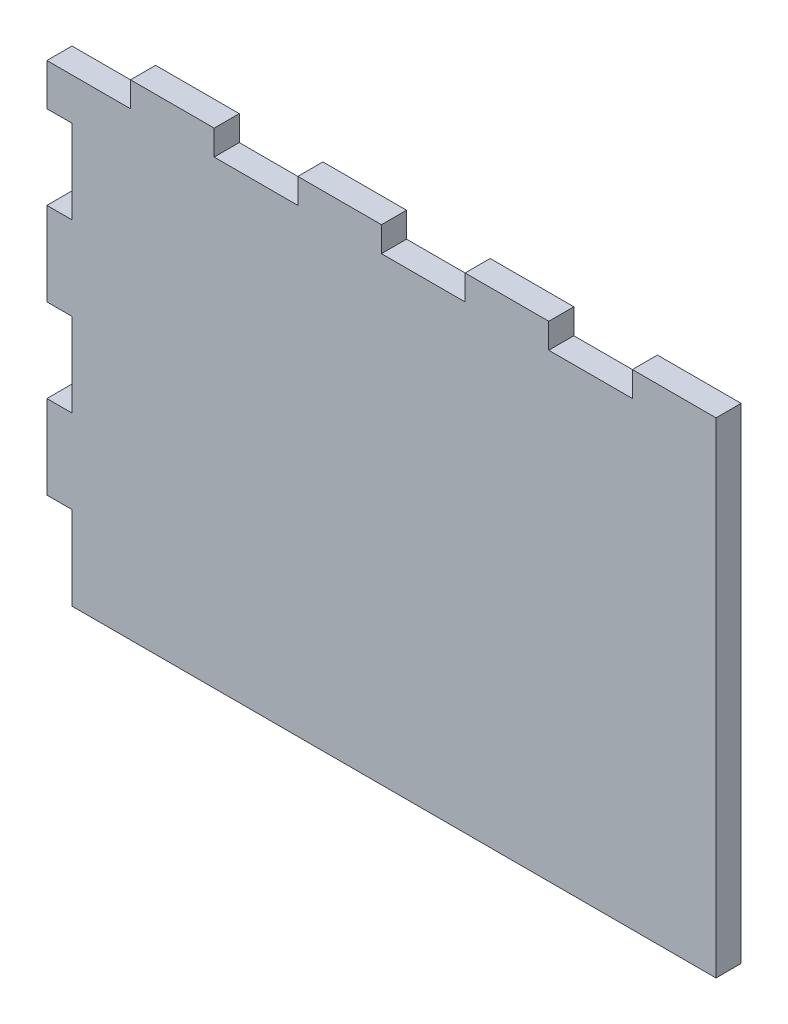
ISO-10303-21;
HEADER;
FILE_DESCRIPTION(('STEP AP214'),'2;1');
FILE_NAME('part.step','',(''),(''),'','','');
FILE_SCHEMA(('AUTOMOTIVE_DESIGN { 1 0 10303 214 1 1 1 1 }'));
ENDSEC;
DATA;
#1=APPLICATION_CONTEXT('core data for automotive mechanical design processes');
#2=APPLICATION_PROTOCOL_DEFINITION('international standard','automotive_design',2000,#1);
#3=PRODUCT_CONTEXT('',#1,'mechanical');
#4=PRODUCT('Part','Part','',(#3));
#5=PRODUCT_RELATED_PRODUCT_CATEGORY('part','',(#4));
#6=PRODUCT_DEFINITION_FORMATION('','',#4);
#7=PRODUCT_DEFINITION_CONTEXT('part definition',#1,'design');
#8=PRODUCT_DEFINITION('design','',#6,#7);
#9=PRODUCT_DEFINITION_SHAPE('','',#8);
#10=(LENGTH_UNIT() NAMED_UNIT(*) SI_UNIT(.MILLI.,.METRE.));
#11=(NAMED_UNIT(*) PLANE_ANGLE_UNIT() SI_UNIT($,.RADIAN.));
#12=(NAMED_UNIT(*) SI_UNIT($,.STERADIAN.) SOLID_ANGLE_UNIT());
#13=UNCERTAINTY_MEASURE_WITH_UNIT(LENGTH_MEASURE(1.E-05),#10,'distance_accuracy_value','');
#14=(GEOMETRIC_REPRESENTATION_CONTEXT(3) GLOBAL_UNCERTAINTY_ASSIGNED_CONTEXT((#13)) GLOBAL_UNIT_ASSIGNED_CONTEXT((#10,
#11,#12)) REPRESENTATION_CONTEXT('',''));
#15=CARTESIAN_POINT('',(0.,0.,0.));
#16=DIRECTION('',(0.,0.,1.));
#17=DIRECTION('',(1.,0.,0.));
#18=AXIS2_PLACEMENT_3D('',#15,#16,#17);
#19=CARTESIAN_POINT('',(0.,0.,3.));
#20=DIRECTION('',(1.,0.,0.));
#21=DIRECTION('',(0.,1.,0.));
#22=AXIS2_PLACEMENT_3D('',#19,#20,#21);
#23=PLANE('',#22);
#24=DIRECTION('',(0.,-1.,0.));
#25=VECTOR('',#24,1.);
#26=CARTESIAN_POINT('',(0.,0.,0.));
#27=LINE('',#26,#25);
#28=CARTESIAN_POINT('',(0.,-18.,0.));
#29=VERTEX_POINT('',#28);
#30=CARTESIAN_POINT('',(0.,-28.,0.));
#31=VERTEX_POINT('',#30);
#32=EDGE_CURVE('E242',#29,#31,#27,.T.);
#33=ORIENTED_EDGE('',*,*,#32,.T.);
#34=DIRECTION('',(0.,0.,1.));
#35=VECTOR('',#34,1.);
#36=CARTESIAN_POINT('',(0.,-28.,0.));
#37=LINE('',#36,#35);
#38=CARTESIAN_POINT('',(0.,-28.,3.));
#39=VERTEX_POINT('',#38);
#40=EDGE_CURVE('E402',#31,#39,#37,.T.);
#41=ORIENTED_EDGE('',*,*,#40,.T.);
#42=DIRECTION('',(0.,-1.,0.));
#43=VECTOR('',#42,1.);
#44=CARTESIAN_POINT('',(0.,0.,3.));
#45=LINE('',#44,#43);
#46=CARTESIAN_POINT('',(0.,-18.,3.));
#47=VERTEX_POINT('',#46);
#48=EDGE_CURVE('E296',#47,#39,#45,.T.);
#49=ORIENTED_EDGE('',*,*,#48,.F.);
#50=DIRECTION('',(0.,0.,1.));
#51=VECTOR('',#50,1.);
#52=CARTESIAN_POINT('',(0.,-18.,0.));
#53=LINE('',#52,#51);
#54=EDGE_CURVE('E405',#29,#47,#53,.T.);
#55=ORIENTED_EDGE('',*,*,#54,.F.);
#56=EDGE_LOOP('',(#33,#41,#49,#55));
#57=FACE_BOUND('',#56,.T.);
#58=ADVANCED_FACE('F35',(#57),#23,.F.);
#59=CARTESIAN_POINT('',(0.,-3.,0.));
#60=VERTEX_POINT('',#59);
#61=CARTESIAN_POINT('',(0.,-8.,0.));
#62=VERTEX_POINT('',#61);
#63=EDGE_CURVE('E245',#60,#62,#27,.T.);
#64=ORIENTED_EDGE('',*,*,#63,.T.);
#65=DIRECTION('',(0.,0.,1.));
#66=VECTOR('',#65,1.);
#67=CARTESIAN_POINT('',(0.,-8.,0.));
#68=LINE('',#67,#66);
#69=CARTESIAN_POINT('',(0.,-8.,3.));
#70=VERTEX_POINT('',#69);
#71=EDGE_CURVE('E412',#62,#70,#68,.T.);
#72=ORIENTED_EDGE('',*,*,#71,.T.);
#73=CARTESIAN_POINT('',(0.,-3.,3.));
#74=VERTEX_POINT('',#73);
#75=EDGE_CURVE('E291',#74,#70,#45,.T.);
#76=ORIENTED_EDGE('',*,*,#75,.F.);
#77=DIRECTION('',(0.,0.,1.));
#78=VECTOR('',#77,1.);
#79=CARTESIAN_POINT('',(0.,-3.,0.));
#80=LINE('',#79,#78);
#81=EDGE_CURVE('E297',#60,#74,#80,.T.);
#82=ORIENTED_EDGE('',*,*,#81,.F.);
#83=EDGE_LOOP('',(#64,#72,#76,#82));
#84=FACE_BOUND('',#83,.T.);
#85=ADVANCED_FACE('F460',(#84),#23,.F.);
#86=CARTESIAN_POINT('',(0.,0.,3.));
#87=DIRECTION('',(0.,-1.,0.));
#88=DIRECTION('',(0.,0.,-1.));
#89=AXIS2_PLACEMENT_3D('',#86,#87,#88);
#90=PLANE('',#89);
#91=DIRECTION('',(-1.,0.,0.));
#92=VECTOR('',#91,1.);
#93=CARTESIAN_POINT('',(0.,0.,3.));
#94=LINE('',#93,#92);
#95=CARTESIAN_POINT('',(20.,0.,3.));
#96=VERTEX_POINT('',#95);
#97=CARTESIAN_POINT('',(10.,0.,3.));
#98=VERTEX_POINT('',#97);
#99=EDGE_CURVE('E277',#96,#98,#94,.T.);
#100=ORIENTED_EDGE('',*,*,#99,.F.);
#101=DIRECTION('',(0.,0.,1.));
#102=VECTOR('',#101,1.);
#103=CARTESIAN_POINT('',(20.,0.,0.));
#104=LINE('',#103,#102);
#105=CARTESIAN_POINT('',(20.,0.,0.));
#106=VERTEX_POINT('',#105);
#107=EDGE_CURVE('E307',#106,#96,#104,.T.);
#108=ORIENTED_EDGE('',*,*,#107,.F.);
#109=DIRECTION('',(-1.,0.,0.));
#110=VECTOR('',#109,1.);
#111=CARTESIAN_POINT('',(0.,0.,0.));
#112=LINE('',#111,#110);
#113=CARTESIAN_POINT('',(10.,0.,0.));
#114=VERTEX_POINT('',#113);
#115=EDGE_CURVE('E263',#106,#114,#112,.T.);
#116=ORIENTED_EDGE('',*,*,#115,.T.);
#117=DIRECTION('',(0.,0.,1.));
#118=VECTOR('',#117,1.);
#119=CARTESIAN_POINT('',(10.,0.,0.));
#120=LINE('',#119,#118);
#121=EDGE_CURVE('E243',#114,#98,#120,.T.);
#122=ORIENTED_EDGE('',*,*,#121,.T.);
#123=EDGE_LOOP('',(#100,#108,#116,#122));
#124=FACE_BOUND('',#123,.T.);
#125=ADVANCED_FACE('F470',(#124),#90,.F.);
#126=CARTESIAN_POINT('',(40.,0.,0.));
#127=VERTEX_POINT('',#126);
#128=CARTESIAN_POINT('',(30.,0.,0.));
#129=VERTEX_POINT('',#128);
#130=EDGE_CURVE('E472',#127,#129,#112,.T.);
#131=ORIENTED_EDGE('',*,*,#130,.T.);
#132=DIRECTION('',(0.,0.,1.));
#133=VECTOR('',#132,1.);
#134=CARTESIAN_POINT('',(30.,0.,0.));
#135=LINE('',#134,#133);
#136=CARTESIAN_POINT('',(30.,0.,3.));
#137=VERTEX_POINT('',#136);
#138=EDGE_CURVE('E371',#129,#137,#135,.T.);
#139=ORIENTED_EDGE('',*,*,#138,.T.);
#140=CARTESIAN_POINT('',(40.,0.,3.));
#141=VERTEX_POINT('',#140);
#142=EDGE_CURVE('E281',#141,#137,#94,.T.);
#143=ORIENTED_EDGE('',*,*,#142,.F.);
#144=DIRECTION('',(0.,0.,1.));
#145=VECTOR('',#144,1.);
#146=CARTESIAN_POINT('',(40.,0.,0.));
#147=LINE('',#146,#145);
#148=EDGE_CURVE('E348',#127,#141,#147,.T.);
#149=ORIENTED_EDGE('',*,*,#148,.F.);
#150=EDGE_LOOP('',(#131,#139,#143,#149));
#151=FACE_BOUND('',#150,.T.);
#152=ADVANCED_FACE('F525',(#151),#90,.F.);
#153=CARTESIAN_POINT('',(60.,0.,0.));
#154=VERTEX_POINT('',#153);
#155=CARTESIAN_POINT('',(50.,0.,0.));
#156=VERTEX_POINT('',#155);
#157=EDGE_CURVE('E268',#154,#156,#112,.T.);
#158=ORIENTED_EDGE('',*,*,#157,.T.);
#159=DIRECTION('',(0.,0.,1.));
#160=VECTOR('',#159,1.);
#161=CARTESIAN_POINT('',(50.,0.,0.));
#162=LINE('',#161,#160);
#163=CARTESIAN_POINT('',(50.,0.,3.));
#164=VERTEX_POINT('',#163);
#165=EDGE_CURVE('E345',#156,#164,#162,.T.);
#166=ORIENTED_EDGE('',*,*,#165,.T.);
#167=CARTESIAN_POINT('',(60.,0.,3.));
#168=VERTEX_POINT('',#167);
#169=EDGE_CURVE('E276',#168,#164,#94,.T.);
#170=ORIENTED_EDGE('',*,*,#169,.F.);
#171=DIRECTION('',(0.,0.,1.));
#172=VECTOR('',#171,1.);
#173=CARTESIAN_POINT('',(60.,0.,0.));
#174=LINE('',#173,#172);
#175=EDGE_CURVE('E320',#154,#168,#174,.T.);
#176=ORIENTED_EDGE('',*,*,#175,.F.);
#177=EDGE_LOOP('',(#158,#166,#170,#176));
#178=FACE_BOUND('',#177,.T.);
#179=ADVANCED_FACE('F481',(#178),#90,.F.);
#180=CARTESIAN_POINT('',(0.,-38.,3.));
#181=VERTEX_POINT('',#180);
#182=CARTESIAN_POINT('',(0.,-48.,3.));
#183=VERTEX_POINT('',#182);
#184=EDGE_CURVE('E235',#181,#183,#45,.T.);
#185=ORIENTED_EDGE('',*,*,#184,.F.);
#186=DIRECTION('',(0.,0.,1.));
#187=VECTOR('',#186,1.);
#188=CARTESIAN_POINT('',(0.,-38.,0.));
#189=LINE('',#188,#187);
#190=CARTESIAN_POINT('',(0.,-38.,0.));
#191=VERTEX_POINT('',#190);
#192=EDGE_CURVE('E223',#191,#181,#189,.T.);
#193=ORIENTED_EDGE('',*,*,#192,.F.);
#194=CARTESIAN_POINT('',(0.,-48.,0.));
#195=VERTEX_POINT('',#194);
#196=EDGE_CURVE('E233',#191,#195,#27,.T.);
#197=ORIENTED_EDGE('',*,*,#196,.T.);
#198=DIRECTION('',(0.,0.,1.));
#199=VECTOR('',#198,1.);
#200=CARTESIAN_POINT('',(0.,-48.,0.));
#201=LINE('',#200,#199);
#202=EDGE_CURVE('E332',#195,#183,#201,.T.);
#203=ORIENTED_EDGE('',*,*,#202,.T.);
#204=EDGE_LOOP('',(#185,#193,#197,#203));
#205=FACE_BOUND('',#204,.T.);
#206=ADVANCED_FACE('F37',(#205),#23,.F.);
#207=CARTESIAN_POINT('',(0.,-58.,3.));
#208=DIRECTION('',(0.,1.,0.));
#209=DIRECTION('',(0.,0.,1.));
#210=AXIS2_PLACEMENT_3D('',#207,#208,#209);
#211=PLANE('',#210);
#212=DIRECTION('',(1.,0.,0.));
#213=VECTOR('',#212,1.);
#214=CARTESIAN_POINT('',(0.,-58.,3.));
#215=LINE('',#214,#213);
#216=CARTESIAN_POINT('',(3.,-58.,3.));
#217=VERTEX_POINT('',#216);
#218=CARTESIAN_POINT('',(80.,-58.,3.));
#219=VERTEX_POINT('',#218);
#220=EDGE_CURVE('E289',#217,#219,#215,.T.);
#221=ORIENTED_EDGE('',*,*,#220,.F.);
#222=DIRECTION('',(0.,0.,1.));
#223=VECTOR('',#222,1.);
#224=CARTESIAN_POINT('',(3.,-58.,0.));
#225=LINE('',#224,#223);
#226=CARTESIAN_POINT('',(3.,-58.,0.));
#227=VERTEX_POINT('',#226);
#228=EDGE_CURVE('E390',#227,#217,#225,.T.);
#229=ORIENTED_EDGE('',*,*,#228,.F.);
#230=DIRECTION('',(1.,0.,0.));
#231=VECTOR('',#230,1.);
#232=CARTESIAN_POINT('',(0.,-58.,0.));
#233=LINE('',#232,#231);
#234=CARTESIAN_POINT('',(80.,-58.,0.));
#235=VERTEX_POINT('',#234);
#236=EDGE_CURVE('E253',#227,#235,#233,.T.);
#237=ORIENTED_EDGE('',*,*,#236,.T.);
#238=DIRECTION('',(0.,0.,-1.));
#239=VECTOR('',#238,1.);
#240=CARTESIAN_POINT('',(80.,-58.,3.));
#241=LINE('',#240,#239);
#242=EDGE_CURVE('E11',#219,#235,#241,.T.);
#243=ORIENTED_EDGE('',*,*,#242,.F.);
#244=EDGE_LOOP('',(#221,#229,#237,#243));
#245=FACE_BOUND('',#244,.T.);
#246=ADVANCED_FACE('F519',(#245),#211,.F.);
#247=CARTESIAN_POINT('',(80.,0.,3.));
#248=DIRECTION('',(-1.,0.,0.));
#249=DIRECTION('',(0.,-1.,0.));
#250=AXIS2_PLACEMENT_3D('',#247,#248,#249);
#251=PLANE('',#250);
#252=DIRECTION('',(0.,1.,0.));
#253=VECTOR('',#252,1.);
#254=CARTESIAN_POINT('',(80.,0.,0.));
#255=LINE('',#254,#253);
#256=CARTESIAN_POINT('',(80.,0.,0.));
#257=VERTEX_POINT('',#256);
#258=EDGE_CURVE('E258',#235,#257,#255,.T.);
#259=ORIENTED_EDGE('',*,*,#258,.T.);
#260=DIRECTION('',(0.,0.,-1.));
#261=VECTOR('',#260,1.);
#262=CARTESIAN_POINT('',(80.,0.,3.));
#263=LINE('',#262,#261);
#264=CARTESIAN_POINT('',(80.,0.,3.));
#265=VERTEX_POINT('',#264);
#266=EDGE_CURVE('E43',#265,#257,#263,.T.);
#267=ORIENTED_EDGE('',*,*,#266,.F.);
#268=DIRECTION('',(0.,1.,0.));
#269=VECTOR('',#268,1.);
#270=CARTESIAN_POINT('',(80.,0.,3.));
#271=LINE('',#270,#269);
#272=EDGE_CURVE('E283',#219,#265,#271,.T.);
#273=ORIENTED_EDGE('',*,*,#272,.F.);
#274=ORIENTED_EDGE('',*,*,#242,.T.);
#275=EDGE_LOOP('',(#259,#267,#273,#274));
#276=FACE_BOUND('',#275,.T.);
#277=ADVANCED_FACE('F524',(#276),#251,.F.);
#278=CARTESIAN_POINT('',(70.,0.,0.));
#279=VERTEX_POINT('',#278);
#280=EDGE_CURVE('E266',#257,#279,#112,.T.);
#281=ORIENTED_EDGE('',*,*,#280,.T.);
#282=DIRECTION('',(0.,0.,1.));
#283=VECTOR('',#282,1.);
#284=CARTESIAN_POINT('',(70.,0.,0.));
#285=LINE('',#284,#283);
#286=CARTESIAN_POINT('',(70.,0.,3.));
#287=VERTEX_POINT('',#286);
#288=EDGE_CURVE('E317',#279,#287,#285,.T.);
#289=ORIENTED_EDGE('',*,*,#288,.T.);
#290=EDGE_CURVE('E270',#265,#287,#94,.T.);
#291=ORIENTED_EDGE('',*,*,#290,.F.);
#292=ORIENTED_EDGE('',*,*,#266,.T.);
#293=EDGE_LOOP('',(#281,#289,#291,#292));
#294=FACE_BOUND('',#293,.T.);
#295=ADVANCED_FACE('F502',(#294),#90,.F.);
#296=CARTESIAN_POINT('',(0.,0.,3.));
#297=DIRECTION('',(0.,0.,1.));
#298=DIRECTION('',(1.,0.,0.));
#299=AXIS2_PLACEMENT_3D('',#296,#297,#298);
#300=PLANE('',#299);
#301=DIRECTION('',(-1.,0.,0.));
#302=VECTOR('',#301,1.);
#303=CARTESIAN_POINT('',(0.,-28.,3.));
#304=LINE('',#303,#302);
#305=CARTESIAN_POINT('',(3.,-28.,3.));
#306=VERTEX_POINT('',#305);
#307=EDGE_CURVE('E228',#306,#39,#304,.T.);
#308=ORIENTED_EDGE('',*,*,#307,.F.);
#309=DIRECTION('',(0.,1.,0.));
#310=VECTOR('',#309,1.);
#311=CARTESIAN_POINT('',(3.,-38.,3.));
#312=LINE('',#311,#310);
#313=CARTESIAN_POINT('',(3.,-38.,3.));
#314=VERTEX_POINT('',#313);
#315=EDGE_CURVE('E435',#314,#306,#312,.T.);
#316=ORIENTED_EDGE('',*,*,#315,.F.);
#317=DIRECTION('',(1.,0.,0.));
#318=VECTOR('',#317,1.);
#319=CARTESIAN_POINT('',(0.,-38.,3.));
#320=LINE('',#319,#318);
#321=EDGE_CURVE('E414',#181,#314,#320,.T.);
#322=ORIENTED_EDGE('',*,*,#321,.F.);
#323=ORIENTED_EDGE('',*,*,#184,.T.);
#324=DIRECTION('',(-1.,0.,0.));
#325=VECTOR('',#324,1.);
#326=CARTESIAN_POINT('',(0.,-48.,3.));
#327=LINE('',#326,#325);
#328=CARTESIAN_POINT('',(3.,-48.,3.));
#329=VERTEX_POINT('',#328);
#330=EDGE_CURVE('E395',#329,#183,#327,.T.);
#331=ORIENTED_EDGE('',*,*,#330,.F.);
#332=DIRECTION('',(0.,1.,0.));
#333=VECTOR('',#332,1.);
#334=CARTESIAN_POINT('',(3.,-58.,3.));
#335=LINE('',#334,#333);
#336=EDGE_CURVE('E399',#217,#329,#335,.T.);
#337=ORIENTED_EDGE('',*,*,#336,.F.);
#338=ORIENTED_EDGE('',*,*,#220,.T.);
#339=ORIENTED_EDGE('',*,*,#272,.T.);
#340=ORIENTED_EDGE('',*,*,#290,.T.);
#341=DIRECTION('',(0.,1.,0.));
#342=VECTOR('',#341,1.);
#343=CARTESIAN_POINT('',(70.,0.,3.));
#344=LINE('',#343,#342);
#345=CARTESIAN_POINT('',(70.,-3.,3.));
#346=VERTEX_POINT('',#345);
#347=EDGE_CURVE('E323',#346,#287,#344,.T.);
#348=ORIENTED_EDGE('',*,*,#347,.F.);
#349=DIRECTION('',(1.,0.,0.));
#350=VECTOR('',#349,1.);
#351=CARTESIAN_POINT('',(60.,-3.,3.));
#352=LINE('',#351,#350);
#353=CARTESIAN_POINT('',(60.,-3.,3.));
#354=VERTEX_POINT('',#353);
#355=EDGE_CURVE('E326',#354,#346,#352,.T.);
#356=ORIENTED_EDGE('',*,*,#355,.F.);
#357=DIRECTION('',(0.,-1.,0.));
#358=VECTOR('',#357,1.);
#359=CARTESIAN_POINT('',(60.,0.,3.));
#360=LINE('',#359,#358);
#361=EDGE_CURVE('E329',#168,#354,#360,.T.);
#362=ORIENTED_EDGE('',*,*,#361,.F.);
#363=ORIENTED_EDGE('',*,*,#169,.T.);
#364=DIRECTION('',(0.,1.,0.));
#365=VECTOR('',#364,1.);
#366=CARTESIAN_POINT('',(50.,0.,3.));
#367=LINE('',#366,#365);
#368=CARTESIAN_POINT('',(50.,-3.,3.));
#369=VERTEX_POINT('',#368);
#370=EDGE_CURVE('E351',#369,#164,#367,.T.);
#371=ORIENTED_EDGE('',*,*,#370,.F.);
#372=DIRECTION('',(1.,0.,0.));
#373=VECTOR('',#372,1.);
#374=CARTESIAN_POINT('',(40.,-3.,3.));
#375=LINE('',#374,#373);
#376=CARTESIAN_POINT('',(40.,-3.,3.));
#377=VERTEX_POINT('',#376);
#378=EDGE_CURVE('E354',#377,#369,#375,.T.);
#379=ORIENTED_EDGE('',*,*,#378,.F.);
#380=DIRECTION('',(0.,-1.,0.));
#381=VECTOR('',#380,1.);
#382=CARTESIAN_POINT('',(40.,0.,3.));
#383=LINE('',#382,#381);
#384=EDGE_CURVE('E322',#141,#377,#383,.T.);
#385=ORIENTED_EDGE('',*,*,#384,.F.);
#386=ORIENTED_EDGE('',*,*,#142,.T.);
#387=DIRECTION('',(0.,1.,0.));
#388=VECTOR('',#387,1.);
#389=CARTESIAN_POINT('',(30.,0.,3.));
#390=LINE('',#389,#388);
#391=CARTESIAN_POINT('',(30.,-3.,3.));
#392=VERTEX_POINT('',#391);
#393=EDGE_CURVE('E375',#392,#137,#390,.T.);
#394=ORIENTED_EDGE('',*,*,#393,.F.);
#395=DIRECTION('',(1.,0.,0.));
#396=VECTOR('',#395,1.);
#397=CARTESIAN_POINT('',(20.,-3.,3.));
#398=LINE('',#397,#396);
#399=CARTESIAN_POINT('',(20.,-3.,3.));
#400=VERTEX_POINT('',#399);
#401=EDGE_CURVE('E378',#400,#392,#398,.T.);
#402=ORIENTED_EDGE('',*,*,#401,.F.);
#403=DIRECTION('',(0.,-1.,0.));
#404=VECTOR('',#403,1.);
#405=CARTESIAN_POINT('',(20.,0.,3.));
#406=LINE('',#405,#404);
#407=EDGE_CURVE('E350',#96,#400,#406,.T.);
#408=ORIENTED_EDGE('',*,*,#407,.F.);
#409=ORIENTED_EDGE('',*,*,#99,.T.);
#410=DIRECTION('',(0.,1.,0.));
#411=VECTOR('',#410,1.);
#412=CARTESIAN_POINT('',(10.,0.,3.));
#413=LINE('',#412,#411);
#414=CARTESIAN_POINT('',(10.,-3.,3.));
#415=VERTEX_POINT('',#414);
#416=EDGE_CURVE('E301',#415,#98,#413,.T.);
#417=ORIENTED_EDGE('',*,*,#416,.F.);
#418=DIRECTION('',(1.,0.,0.));
#419=VECTOR('',#418,1.);
#420=CARTESIAN_POINT('',(0.,-3.,3.));
#421=LINE('',#420,#419);
#422=EDGE_CURVE('E304',#74,#415,#421,.T.);
#423=ORIENTED_EDGE('',*,*,#422,.F.);
#424=ORIENTED_EDGE('',*,*,#75,.T.);
#425=DIRECTION('',(-1.,0.,0.));
#426=VECTOR('',#425,1.);
#427=CARTESIAN_POINT('',(0.,-8.,3.));
#428=LINE('',#427,#426);
#429=CARTESIAN_POINT('',(3.,-8.,3.));
#430=VERTEX_POINT('',#429);
#431=EDGE_CURVE('E415',#430,#70,#428,.T.);
#432=ORIENTED_EDGE('',*,*,#431,.F.);
#433=DIRECTION('',(0.,1.,0.));
#434=VECTOR('',#433,1.);
#435=CARTESIAN_POINT('',(3.,-18.,3.));
#436=LINE('',#435,#434);
#437=CARTESIAN_POINT('',(3.,-18.,3.));
#438=VERTEX_POINT('',#437);
#439=EDGE_CURVE('E418',#438,#430,#436,.T.);
#440=ORIENTED_EDGE('',*,*,#439,.F.);
#441=DIRECTION('',(1.,0.,0.));
#442=VECTOR('',#441,1.);
#443=CARTESIAN_POINT('',(0.,-18.,3.));
#444=LINE('',#443,#442);
#445=EDGE_CURVE('E421',#47,#438,#444,.T.);
#446=ORIENTED_EDGE('',*,*,#445,.F.);
#447=ORIENTED_EDGE('',*,*,#48,.T.);
#448=EDGE_LOOP('',(#308,#316,#322,#323,#331,#337,#338,#339,#340,#348,#356,#362,#363,#371,#379,
#385,#386,#394,#402,#408,#409,#417,#423,#424,#432,#440,#446,#447));
#449=FACE_BOUND('',#448,.T.);
#450=ADVANCED_FACE('F453',(#449),#300,.T.);
#451=CARTESIAN_POINT('',(0.,0.,0.));
#452=DIRECTION('',(0.,0.,1.));
#453=DIRECTION('',(1.,0.,0.));
#454=AXIS2_PLACEMENT_3D('',#451,#452,#453);
#455=PLANE('',#454);
#456=DIRECTION('',(0.,1.,0.));
#457=VECTOR('',#456,1.);
#458=CARTESIAN_POINT('',(3.,-38.,0.));
#459=LINE('',#458,#457);
#460=CARTESIAN_POINT('',(3.,-38.,0.));
#461=VERTEX_POINT('',#460);
#462=CARTESIAN_POINT('',(3.,-28.,0.));
#463=VERTEX_POINT('',#462);
#464=EDGE_CURVE('E50',#461,#463,#459,.T.);
#465=ORIENTED_EDGE('',*,*,#464,.T.);
#466=DIRECTION('',(-1.,0.,0.));
#467=VECTOR('',#466,1.);
#468=CARTESIAN_POINT('',(0.,-28.,0.));
#469=LINE('',#468,#467);
#470=EDGE_CURVE('E236',#463,#31,#469,.T.);
#471=ORIENTED_EDGE('',*,*,#470,.T.);
#472=ORIENTED_EDGE('',*,*,#32,.F.);
#473=DIRECTION('',(1.,0.,0.));
#474=VECTOR('',#473,1.);
#475=CARTESIAN_POINT('',(0.,-18.,0.));
#476=LINE('',#475,#474);
#477=CARTESIAN_POINT('',(3.,-18.,0.));
#478=VERTEX_POINT('',#477);
#479=EDGE_CURVE('E417',#29,#478,#476,.T.);
#480=ORIENTED_EDGE('',*,*,#479,.T.);
#481=DIRECTION('',(0.,1.,0.));
#482=VECTOR('',#481,1.);
#483=CARTESIAN_POINT('',(3.,-18.,0.));
#484=LINE('',#483,#482);
#485=CARTESIAN_POINT('',(3.,-8.,0.));
#486=VERTEX_POINT('',#485);
#487=EDGE_CURVE('E58',#478,#486,#484,.T.);
#488=ORIENTED_EDGE('',*,*,#487,.T.);
#489=DIRECTION('',(-1.,0.,0.));
#490=VECTOR('',#489,1.);
#491=CARTESIAN_POINT('',(0.,-8.,0.));
#492=LINE('',#491,#490);
#493=EDGE_CURVE('E408',#486,#62,#492,.T.);
#494=ORIENTED_EDGE('',*,*,#493,.T.);
#495=ORIENTED_EDGE('',*,*,#63,.F.);
#496=DIRECTION('',(1.,0.,0.));
#497=VECTOR('',#496,1.);
#498=CARTESIAN_POINT('',(0.,-3.,0.));
#499=LINE('',#498,#497);
#500=CARTESIAN_POINT('',(10.,-3.,0.));
#501=VERTEX_POINT('',#500);
#502=EDGE_CURVE('E303',#60,#501,#499,.T.);
#503=ORIENTED_EDGE('',*,*,#502,.T.);
#504=DIRECTION('',(0.,1.,0.));
#505=VECTOR('',#504,1.);
#506=CARTESIAN_POINT('',(10.,0.,0.));
#507=LINE('',#506,#505);
#508=EDGE_CURVE('E299',#501,#114,#507,.T.);
#509=ORIENTED_EDGE('',*,*,#508,.T.);
#510=ORIENTED_EDGE('',*,*,#115,.F.);
#511=DIRECTION('',(0.,-1.,0.));
#512=VECTOR('',#511,1.);
#513=CARTESIAN_POINT('',(20.,0.,0.));
#514=LINE('',#513,#512);
#515=CARTESIAN_POINT('',(20.,-3.,0.));
#516=VERTEX_POINT('',#515);
#517=EDGE_CURVE('E377',#106,#516,#514,.T.);
#518=ORIENTED_EDGE('',*,*,#517,.T.);
#519=DIRECTION('',(1.,0.,0.));
#520=VECTOR('',#519,1.);
#521=CARTESIAN_POINT('',(20.,-3.,0.));
#522=LINE('',#521,#520);
#523=CARTESIAN_POINT('',(30.,-3.,0.));
#524=VERTEX_POINT('',#523);
#525=EDGE_CURVE('E385',#516,#524,#522,.T.);
#526=ORIENTED_EDGE('',*,*,#525,.T.);
#527=DIRECTION('',(0.,1.,0.));
#528=VECTOR('',#527,1.);
#529=CARTESIAN_POINT('',(30.,0.,0.));
#530=LINE('',#529,#528);
#531=EDGE_CURVE('E369',#524,#129,#530,.T.);
#532=ORIENTED_EDGE('',*,*,#531,.T.);
#533=ORIENTED_EDGE('',*,*,#130,.F.);
#534=DIRECTION('',(0.,-1.,0.));
#535=VECTOR('',#534,1.);
#536=CARTESIAN_POINT('',(40.,0.,0.));
#537=LINE('',#536,#535);
#538=CARTESIAN_POINT('',(40.,-3.,0.));
#539=VERTEX_POINT('',#538);
#540=EDGE_CURVE('E353',#127,#539,#537,.T.);
#541=ORIENTED_EDGE('',*,*,#540,.T.);
#542=DIRECTION('',(1.,0.,0.));
#543=VECTOR('',#542,1.);
#544=CARTESIAN_POINT('',(40.,-3.,0.));
#545=LINE('',#544,#543);
#546=CARTESIAN_POINT('',(50.,-3.,0.));
#547=VERTEX_POINT('',#546);
#548=EDGE_CURVE('E361',#539,#547,#545,.T.);
#549=ORIENTED_EDGE('',*,*,#548,.T.);
#550=DIRECTION('',(0.,1.,0.));
#551=VECTOR('',#550,1.);
#552=CARTESIAN_POINT('',(50.,0.,0.));
#553=LINE('',#552,#551);
#554=EDGE_CURVE('E343',#547,#156,#553,.T.);
#555=ORIENTED_EDGE('',*,*,#554,.T.);
#556=ORIENTED_EDGE('',*,*,#157,.F.);
#557=DIRECTION('',(0.,-1.,0.));
#558=VECTOR('',#557,1.);
#559=CARTESIAN_POINT('',(60.,0.,0.));
#560=LINE('',#559,#558);
#561=CARTESIAN_POINT('',(60.,-3.,0.));
#562=VERTEX_POINT('',#561);
#563=EDGE_CURVE('E325',#154,#562,#560,.T.);
#564=ORIENTED_EDGE('',*,*,#563,.T.);
#565=DIRECTION('',(1.,0.,0.));
#566=VECTOR('',#565,1.);
#567=CARTESIAN_POINT('',(60.,-3.,0.));
#568=LINE('',#567,#566);
#569=CARTESIAN_POINT('',(70.,-3.,0.));
#570=VERTEX_POINT('',#569);
#571=EDGE_CURVE('E335',#562,#570,#568,.T.);
#572=ORIENTED_EDGE('',*,*,#571,.T.);
#573=DIRECTION('',(0.,1.,0.));
#574=VECTOR('',#573,1.);
#575=CARTESIAN_POINT('',(70.,0.,0.));
#576=LINE('',#575,#574);
#577=EDGE_CURVE('E315',#570,#279,#576,.T.);
#578=ORIENTED_EDGE('',*,*,#577,.T.);
#579=ORIENTED_EDGE('',*,*,#280,.F.);
#580=ORIENTED_EDGE('',*,*,#258,.F.);
#581=ORIENTED_EDGE('',*,*,#236,.F.);
#582=DIRECTION('',(0.,1.,0.));
#583=VECTOR('',#582,1.);
#584=CARTESIAN_POINT('',(3.,-58.,0.));
#585=LINE('',#584,#583);
#586=CARTESIAN_POINT('',(3.,-48.,0.));
#587=VERTEX_POINT('',#586);
#588=EDGE_CURVE('E398',#227,#587,#585,.T.);
#589=ORIENTED_EDGE('',*,*,#588,.T.);
#590=DIRECTION('',(-1.,0.,0.));
#591=VECTOR('',#590,1.);
#592=CARTESIAN_POINT('',(0.,-48.,0.));
#593=LINE('',#592,#591);
#594=EDGE_CURVE('E241',#587,#195,#593,.T.);
#595=ORIENTED_EDGE('',*,*,#594,.T.);
#596=ORIENTED_EDGE('',*,*,#196,.F.);
#597=DIRECTION('',(1.,0.,0.));
#598=VECTOR('',#597,1.);
#599=CARTESIAN_POINT('',(0.,-38.,0.));
#600=LINE('',#599,#598);
#601=EDGE_CURVE('E219',#191,#461,#600,.T.);
#602=ORIENTED_EDGE('',*,*,#601,.T.);
#603=EDGE_LOOP('',(#465,#471,#472,#480,#488,#494,#495,#503,#509,#510,#518,#526,#532,#533,#541,
#549,#555,#556,#564,#572,#578,#579,#580,#581,#589,#595,#596,#602));
#604=FACE_BOUND('',#603,.T.);
#605=ADVANCED_FACE('F239',(#604),#455,.F.);
#606=CARTESIAN_POINT('',(10.,0.,0.));
#607=DIRECTION('',(1.,0.,0.));
#608=DIRECTION('',(0.,0.,-1.));
#609=AXIS2_PLACEMENT_3D('',#606,#607,#608);
#610=PLANE('',#609);
#611=ORIENTED_EDGE('',*,*,#416,.T.);
#612=ORIENTED_EDGE('',*,*,#121,.F.);
#613=ORIENTED_EDGE('',*,*,#508,.F.);
#614=DIRECTION('',(0.,0.,1.));
#615=VECTOR('',#614,1.);
#616=CARTESIAN_POINT('',(10.,-3.,0.));
#617=LINE('',#616,#615);
#618=EDGE_CURVE('E248',#501,#415,#617,.T.);
#619=ORIENTED_EDGE('',*,*,#618,.T.);
#620=EDGE_LOOP('',(#611,#612,#613,#619));
#621=FACE_BOUND('',#620,.T.);
#622=ADVANCED_FACE('F468',(#621),#610,.F.);
#623=CARTESIAN_POINT('',(0.,-3.,0.));
#624=DIRECTION('',(0.,-1.,0.));
#625=DIRECTION('',(0.,0.,-1.));
#626=AXIS2_PLACEMENT_3D('',#623,#624,#625);
#627=PLANE('',#626);
#628=ORIENTED_EDGE('',*,*,#422,.T.);
#629=ORIENTED_EDGE('',*,*,#618,.F.);
#630=ORIENTED_EDGE('',*,*,#502,.F.);
#631=ORIENTED_EDGE('',*,*,#81,.T.);
#632=EDGE_LOOP('',(#628,#629,#630,#631));
#633=FACE_BOUND('',#632,.T.);
#634=ADVANCED_FACE('F464',(#633),#627,.F.);
#635=CARTESIAN_POINT('',(60.,0.,0.));
#636=DIRECTION('',(-1.,0.,0.));
#637=DIRECTION('',(0.,-1.,0.));
#638=AXIS2_PLACEMENT_3D('',#635,#636,#637);
#639=PLANE('',#638);
#640=ORIENTED_EDGE('',*,*,#361,.T.);
#641=DIRECTION('',(0.,0.,1.));
#642=VECTOR('',#641,1.);
#643=CARTESIAN_POINT('',(60.,-3.,0.));
#644=LINE('',#643,#642);
#645=EDGE_CURVE('E312',#562,#354,#644,.T.);
#646=ORIENTED_EDGE('',*,*,#645,.F.);
#647=ORIENTED_EDGE('',*,*,#563,.F.);
#648=ORIENTED_EDGE('',*,*,#175,.T.);
#649=EDGE_LOOP('',(#640,#646,#647,#648));
#650=FACE_BOUND('',#649,.T.);
#651=ADVANCED_FACE('F495',(#650),#639,.F.);
#652=CARTESIAN_POINT('',(70.,0.,0.));
#653=DIRECTION('',(1.,0.,0.));
#654=DIRECTION('',(0.,0.,-1.));
#655=AXIS2_PLACEMENT_3D('',#652,#653,#654);
#656=PLANE('',#655);
#657=ORIENTED_EDGE('',*,*,#347,.T.);
#658=ORIENTED_EDGE('',*,*,#288,.F.);
#659=ORIENTED_EDGE('',*,*,#577,.F.);
#660=DIRECTION('',(0.,0.,1.));
#661=VECTOR('',#660,1.);
#662=CARTESIAN_POINT('',(70.,-3.,0.));
#663=LINE('',#662,#661);
#664=EDGE_CURVE('E314',#570,#346,#663,.T.);
#665=ORIENTED_EDGE('',*,*,#664,.T.);
#666=EDGE_LOOP('',(#657,#658,#659,#665));
#667=FACE_BOUND('',#666,.T.);
#668=ADVANCED_FACE('F503',(#667),#656,.F.);
#669=CARTESIAN_POINT('',(60.,-3.,0.));
#670=DIRECTION('',(0.,-1.,0.));
#671=DIRECTION('',(0.,0.,-1.));
#672=AXIS2_PLACEMENT_3D('',#669,#670,#671);
#673=PLANE('',#672);
#674=ORIENTED_EDGE('',*,*,#355,.T.);
#675=ORIENTED_EDGE('',*,*,#664,.F.);
#676=ORIENTED_EDGE('',*,*,#571,.F.);
#677=ORIENTED_EDGE('',*,*,#645,.T.);
#678=EDGE_LOOP('',(#674,#675,#676,#677));
#679=FACE_BOUND('',#678,.T.);
#680=ADVANCED_FACE('F499',(#679),#673,.F.);
#681=CARTESIAN_POINT('',(40.,0.,0.));
#682=DIRECTION('',(-1.,0.,0.));
#683=DIRECTION('',(0.,-1.,0.));
#684=AXIS2_PLACEMENT_3D('',#681,#682,#683);
#685=PLANE('',#684);
#686=ORIENTED_EDGE('',*,*,#384,.T.);
#687=DIRECTION('',(0.,0.,1.));
#688=VECTOR('',#687,1.);
#689=CARTESIAN_POINT('',(40.,-3.,0.));
#690=LINE('',#689,#688);
#691=EDGE_CURVE('E340',#539,#377,#690,.T.);
#692=ORIENTED_EDGE('',*,*,#691,.F.);
#693=ORIENTED_EDGE('',*,*,#540,.F.);
#694=ORIENTED_EDGE('',*,*,#148,.T.);
#695=EDGE_LOOP('',(#686,#692,#693,#694));
#696=FACE_BOUND('',#695,.T.);
#697=ADVANCED_FACE('F510',(#696),#685,.F.);
#698=CARTESIAN_POINT('',(50.,0.,0.));
#699=DIRECTION('',(1.,0.,0.));
#700=DIRECTION('',(0.,0.,-1.));
#701=AXIS2_PLACEMENT_3D('',#698,#699,#700);
#702=PLANE('',#701);
#703=ORIENTED_EDGE('',*,*,#370,.T.);
#704=ORIENTED_EDGE('',*,*,#165,.F.);
#705=ORIENTED_EDGE('',*,*,#554,.F.);
#706=DIRECTION('',(0.,0.,1.));
#707=VECTOR('',#706,1.);
#708=CARTESIAN_POINT('',(50.,-3.,0.));
#709=LINE('',#708,#707);
#710=EDGE_CURVE('E342',#547,#369,#709,.T.);
#711=ORIENTED_EDGE('',*,*,#710,.T.);
#712=EDGE_LOOP('',(#703,#704,#705,#711));
#713=FACE_BOUND('',#712,.T.);
#714=ADVANCED_FACE('F486',(#713),#702,.F.);
#715=CARTESIAN_POINT('',(40.,-3.,0.));
#716=DIRECTION('',(0.,-1.,0.));
#717=DIRECTION('',(0.,0.,-1.));
#718=AXIS2_PLACEMENT_3D('',#715,#716,#717);
#719=PLANE('',#718);
#720=ORIENTED_EDGE('',*,*,#378,.T.);
#721=ORIENTED_EDGE('',*,*,#710,.F.);
#722=ORIENTED_EDGE('',*,*,#548,.F.);
#723=ORIENTED_EDGE('',*,*,#691,.T.);
#724=EDGE_LOOP('',(#720,#721,#722,#723));
#725=FACE_BOUND('',#724,.T.);
#726=ADVANCED_FACE('F488',(#725),#719,.F.);
#727=CARTESIAN_POINT('',(20.,0.,0.));
#728=DIRECTION('',(-1.,0.,0.));
#729=DIRECTION('',(0.,-1.,0.));
#730=AXIS2_PLACEMENT_3D('',#727,#728,#729);
#731=PLANE('',#730);
#732=ORIENTED_EDGE('',*,*,#407,.T.);
#733=DIRECTION('',(0.,0.,1.));
#734=VECTOR('',#733,1.);
#735=CARTESIAN_POINT('',(20.,-3.,0.));
#736=LINE('',#735,#734);
#737=EDGE_CURVE('E366',#516,#400,#736,.T.);
#738=ORIENTED_EDGE('',*,*,#737,.F.);
#739=ORIENTED_EDGE('',*,*,#517,.F.);
#740=ORIENTED_EDGE('',*,*,#107,.T.);
#741=EDGE_LOOP('',(#732,#738,#739,#740));
#742=FACE_BOUND('',#741,.T.);
#743=ADVANCED_FACE('F602',(#742),#731,.F.);
#744=CARTESIAN_POINT('',(30.,0.,0.));
#745=DIRECTION('',(1.,0.,0.));
#746=DIRECTION('',(0.,0.,-1.));
#747=AXIS2_PLACEMENT_3D('',#744,#745,#746);
#748=PLANE('',#747);
#749=ORIENTED_EDGE('',*,*,#393,.T.);
#750=ORIENTED_EDGE('',*,*,#138,.F.);
#751=ORIENTED_EDGE('',*,*,#531,.F.);
#752=DIRECTION('',(0.,0.,1.));
#753=VECTOR('',#752,1.);
#754=CARTESIAN_POINT('',(30.,-3.,0.));
#755=LINE('',#754,#753);
#756=EDGE_CURVE('E368',#524,#392,#755,.T.);
#757=ORIENTED_EDGE('',*,*,#756,.T.);
#758=EDGE_LOOP('',(#749,#750,#751,#757));
#759=FACE_BOUND('',#758,.T.);
#760=ADVANCED_FACE('F611',(#759),#748,.F.);
#761=CARTESIAN_POINT('',(20.,-3.,0.));
#762=DIRECTION('',(0.,-1.,0.));
#763=DIRECTION('',(0.,0.,-1.));
#764=AXIS2_PLACEMENT_3D('',#761,#762,#763);
#765=PLANE('',#764);
#766=ORIENTED_EDGE('',*,*,#401,.T.);
#767=ORIENTED_EDGE('',*,*,#756,.F.);
#768=ORIENTED_EDGE('',*,*,#525,.F.);
#769=ORIENTED_EDGE('',*,*,#737,.T.);
#770=EDGE_LOOP('',(#766,#767,#768,#769));
#771=FACE_BOUND('',#770,.T.);
#772=ADVANCED_FACE('F621',(#771),#765,.F.);
#773=CARTESIAN_POINT('',(0.,-48.,0.));
#774=DIRECTION('',(0.,1.,0.));
#775=DIRECTION('',(0.,0.,1.));
#776=AXIS2_PLACEMENT_3D('',#773,#774,#775);
#777=PLANE('',#776);
#778=ORIENTED_EDGE('',*,*,#330,.T.);
#779=ORIENTED_EDGE('',*,*,#202,.F.);
#780=ORIENTED_EDGE('',*,*,#594,.F.);
#781=DIRECTION('',(0.,0.,1.));
#782=VECTOR('',#781,1.);
#783=CARTESIAN_POINT('',(3.,-48.,0.));
#784=LINE('',#783,#782);
#785=EDGE_CURVE('E392',#587,#329,#784,.T.);
#786=ORIENTED_EDGE('',*,*,#785,.T.);
#787=EDGE_LOOP('',(#778,#779,#780,#786));
#788=FACE_BOUND('',#787,.T.);
#789=ADVANCED_FACE('F631',(#788),#777,.F.);
#790=CARTESIAN_POINT('',(3.,-58.,0.));
#791=DIRECTION('',(1.,0.,0.));
#792=DIRECTION('',(0.,0.,-1.));
#793=AXIS2_PLACEMENT_3D('',#790,#791,#792);
#794=PLANE('',#793);
#795=ORIENTED_EDGE('',*,*,#336,.T.);
#796=ORIENTED_EDGE('',*,*,#785,.F.);
#797=ORIENTED_EDGE('',*,*,#588,.F.);
#798=ORIENTED_EDGE('',*,*,#228,.T.);
#799=EDGE_LOOP('',(#795,#796,#797,#798));
#800=FACE_BOUND('',#799,.T.);
#801=ADVANCED_FACE('F648',(#800),#794,.F.);
#802=CARTESIAN_POINT('',(0.,-8.,0.));
#803=DIRECTION('',(0.,1.,0.));
#804=DIRECTION('',(0.,0.,1.));
#805=AXIS2_PLACEMENT_3D('',#802,#803,#804);
#806=PLANE('',#805);
#807=ORIENTED_EDGE('',*,*,#431,.T.);
#808=ORIENTED_EDGE('',*,*,#71,.F.);
#809=ORIENTED_EDGE('',*,*,#493,.F.);
#810=DIRECTION('',(0.,0.,1.));
#811=VECTOR('',#810,1.);
#812=CARTESIAN_POINT('',(3.,-8.,0.));
#813=LINE('',#812,#811);
#814=EDGE_CURVE('E410',#486,#430,#813,.T.);
#815=ORIENTED_EDGE('',*,*,#814,.T.);
#816=EDGE_LOOP('',(#807,#808,#809,#815));
#817=FACE_BOUND('',#816,.T.);
#818=ADVANCED_FACE('F458',(#817),#806,.F.);
#819=CARTESIAN_POINT('',(3.,-18.,0.));
#820=DIRECTION('',(1.,0.,0.));
#821=DIRECTION('',(0.,0.,-1.));
#822=AXIS2_PLACEMENT_3D('',#819,#820,#821);
#823=PLANE('',#822);
#824=ORIENTED_EDGE('',*,*,#439,.T.);
#825=ORIENTED_EDGE('',*,*,#814,.F.);
#826=ORIENTED_EDGE('',*,*,#487,.F.);
#827=DIRECTION('',(0.,0.,1.));
#828=VECTOR('',#827,1.);
#829=CARTESIAN_POINT('',(3.,-18.,0.));
#830=LINE('',#829,#828);
#831=EDGE_CURVE('E407',#478,#438,#830,.T.);
#832=ORIENTED_EDGE('',*,*,#831,.T.);
#833=EDGE_LOOP('',(#824,#825,#826,#832));
#834=FACE_BOUND('',#833,.T.);
#835=ADVANCED_FACE('F455',(#834),#823,.F.);
#836=CARTESIAN_POINT('',(0.,-18.,0.));
#837=DIRECTION('',(0.,-1.,0.));
#838=DIRECTION('',(0.,0.,-1.));
#839=AXIS2_PLACEMENT_3D('',#836,#837,#838);
#840=PLANE('',#839);
#841=ORIENTED_EDGE('',*,*,#445,.T.);
#842=ORIENTED_EDGE('',*,*,#831,.F.);
#843=ORIENTED_EDGE('',*,*,#479,.F.);
#844=ORIENTED_EDGE('',*,*,#54,.T.);
#845=EDGE_LOOP('',(#841,#842,#843,#844));
#846=FACE_BOUND('',#845,.T.);
#847=ADVANCED_FACE('F450',(#846),#840,.F.);
#848=CARTESIAN_POINT('',(0.,-28.,0.));
#849=DIRECTION('',(0.,1.,0.));
#850=DIRECTION('',(0.,0.,1.));
#851=AXIS2_PLACEMENT_3D('',#848,#849,#850);
#852=PLANE('',#851);
#853=ORIENTED_EDGE('',*,*,#307,.T.);
#854=ORIENTED_EDGE('',*,*,#40,.F.);
#855=ORIENTED_EDGE('',*,*,#470,.F.);
#856=DIRECTION('',(0.,0.,1.));
#857=VECTOR('',#856,1.);
#858=CARTESIAN_POINT('',(3.,-28.,0.));
#859=LINE('',#858,#857);
#860=EDGE_CURVE('E430',#463,#306,#859,.T.);
#861=ORIENTED_EDGE('',*,*,#860,.T.);
#862=EDGE_LOOP('',(#853,#854,#855,#861));
#863=FACE_BOUND('',#862,.T.);
#864=ADVANCED_FACE('F707',(#863),#852,.F.);
#865=CARTESIAN_POINT('',(3.,-38.,0.));
#866=DIRECTION('',(1.,0.,0.));
#867=DIRECTION('',(0.,0.,-1.));
#868=AXIS2_PLACEMENT_3D('',#865,#866,#867);
#869=PLANE('',#868);
#870=ORIENTED_EDGE('',*,*,#315,.T.);
#871=ORIENTED_EDGE('',*,*,#860,.F.);
#872=ORIENTED_EDGE('',*,*,#464,.F.);
#873=DIRECTION('',(0.,0.,1.));
#874=VECTOR('',#873,1.);
#875=CARTESIAN_POINT('',(3.,-38.,0.));
#876=LINE('',#875,#874);
#877=EDGE_CURVE('E225',#461,#314,#876,.T.);
#878=ORIENTED_EDGE('',*,*,#877,.T.);
#879=EDGE_LOOP('',(#870,#871,#872,#878));
#880=FACE_BOUND('',#879,.T.);
#881=ADVANCED_FACE('F716',(#880),#869,.F.);
#882=CARTESIAN_POINT('',(0.,-38.,0.));
#883=DIRECTION('',(0.,-1.,0.));
#884=DIRECTION('',(0.,0.,-1.));
#885=AXIS2_PLACEMENT_3D('',#882,#883,#884);
#886=PLANE('',#885);
#887=ORIENTED_EDGE('',*,*,#321,.T.);
#888=ORIENTED_EDGE('',*,*,#877,.F.);
#889=ORIENTED_EDGE('',*,*,#601,.F.);
#890=ORIENTED_EDGE('',*,*,#192,.T.);
#891=EDGE_LOOP('',(#887,#888,#889,#890));
#892=FACE_BOUND('',#891,.T.);
#893=ADVANCED_FACE('F222',(#892),#886,.F.);
#894=CLOSED_SHELL('',(#58,#85,#125,#152,#179,#206,#246,#277,#295,#450,#605,#622,#634,#651,#668,
#680,#697,#714,#726,#743,#760,#772,#789,#801,#818,#835,#847,#864,#881,#893));
#895=MANIFOLD_SOLID_BREP('B2',#894);
#896=ADVANCED_BREP_SHAPE_REPRESENTATION('',(#18,#895),#14);
#897=SHAPE_DEFINITION_REPRESENTATION(#9,#896);
ENDSEC;
END-ISO-10303-21;
